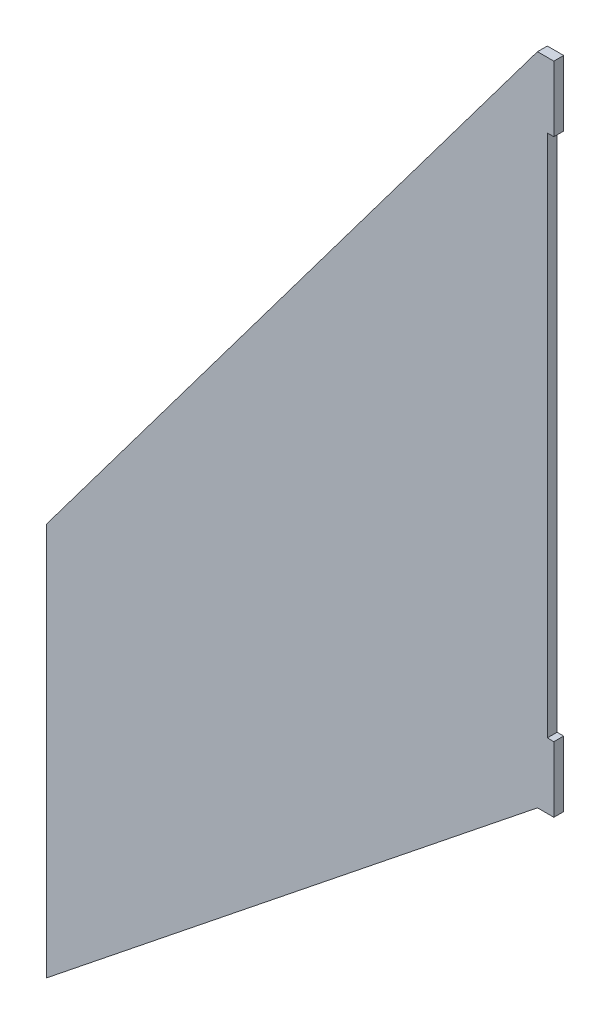
ISO-10303-21;
HEADER;
FILE_DESCRIPTION(('STEP AP214'),'2;1');
FILE_NAME('part.step','',(''),(''),'','','');
FILE_SCHEMA(('AUTOMOTIVE_DESIGN { 1 0 10303 214 1 1 1 1 }'));
ENDSEC;
DATA;
#1=APPLICATION_CONTEXT('core data for automotive mechanical design processes');
#2=APPLICATION_PROTOCOL_DEFINITION('international standard','automotive_design',2000,#1);
#3=PRODUCT_CONTEXT('',#1,'mechanical');
#4=PRODUCT('Part','Part','',(#3));
#5=PRODUCT_RELATED_PRODUCT_CATEGORY('part','',(#4));
#6=PRODUCT_DEFINITION_FORMATION('','',#4);
#7=PRODUCT_DEFINITION_CONTEXT('part definition',#1,'design');
#8=PRODUCT_DEFINITION('design','',#6,#7);
#9=PRODUCT_DEFINITION_SHAPE('','',#8);
#10=(LENGTH_UNIT() NAMED_UNIT(*) SI_UNIT(.MILLI.,.METRE.));
#11=(NAMED_UNIT(*) PLANE_ANGLE_UNIT() SI_UNIT($,.RADIAN.));
#12=(NAMED_UNIT(*) SI_UNIT($,.STERADIAN.) SOLID_ANGLE_UNIT());
#13=UNCERTAINTY_MEASURE_WITH_UNIT(LENGTH_MEASURE(1.E-05),#10,'distance_accuracy_value','');
#14=(GEOMETRIC_REPRESENTATION_CONTEXT(3) GLOBAL_UNCERTAINTY_ASSIGNED_CONTEXT((#13)) GLOBAL_UNIT_ASSIGNED_CONTEXT((#10,
#11,#12)) REPRESENTATION_CONTEXT('',''));
#15=CARTESIAN_POINT('',(0.,0.,0.));
#16=DIRECTION('',(0.,0.,1.));
#17=DIRECTION('',(1.,0.,0.));
#18=AXIS2_PLACEMENT_3D('',#15,#16,#17);
#19=CARTESIAN_POINT('',(0.,0.,3.));
#20=DIRECTION('',(-1.,0.,0.));
#21=DIRECTION('',(0.,-1.,0.));
#22=AXIS2_PLACEMENT_3D('',#19,#20,#21);
#23=PLANE('',#22);
#24=DIRECTION('',(0.,1.,0.));
#25=VECTOR('',#24,1.);
#26=CARTESIAN_POINT('',(0.,0.,0.));
#27=LINE('',#26,#25);
#28=CARTESIAN_POINT('',(0.,-20.,0.));
#29=VERTEX_POINT('',#28);
#30=CARTESIAN_POINT('',(0.,0.,0.));
#31=VERTEX_POINT('',#30);
#32=EDGE_CURVE('E145',#29,#31,#27,.T.);
#33=ORIENTED_EDGE('',*,*,#32,.T.);
#34=DIRECTION('',(0.,0.,-1.));
#35=VECTOR('',#34,1.);
#36=CARTESIAN_POINT('',(0.,0.,3.));
#37=LINE('',#36,#35);
#38=CARTESIAN_POINT('',(0.,0.,3.));
#39=VERTEX_POINT('',#38);
#40=EDGE_CURVE('E11',#39,#31,#37,.T.);
#41=ORIENTED_EDGE('',*,*,#40,.F.);
#42=DIRECTION('',(0.,1.,0.));
#43=VECTOR('',#42,1.);
#44=CARTESIAN_POINT('',(0.,0.,3.));
#45=LINE('',#44,#43);
#46=CARTESIAN_POINT('',(0.,-20.,3.));
#47=VERTEX_POINT('',#46);
#48=EDGE_CURVE('E163',#47,#39,#45,.T.);
#49=ORIENTED_EDGE('',*,*,#48,.F.);
#50=DIRECTION('',(0.,0.,-1.));
#51=VECTOR('',#50,1.);
#52=CARTESIAN_POINT('',(0.,-20.,3.));
#53=LINE('',#52,#51);
#54=EDGE_CURVE('E141',#47,#29,#53,.T.);
#55=ORIENTED_EDGE('',*,*,#54,.T.);
#56=EDGE_LOOP('',(#33,#41,#49,#55));
#57=FACE_BOUND('',#56,.T.);
#58=ADVANCED_FACE('F37',(#57),#23,.F.);
#59=CARTESIAN_POINT('',(0.,0.,3.));
#60=DIRECTION('',(0.,-1.,0.));
#61=DIRECTION('',(1.,0.,0.));
#62=AXIS2_PLACEMENT_3D('',#59,#60,#61);
#63=PLANE('',#62);
#64=DIRECTION('',(-1.,0.,0.));
#65=VECTOR('',#64,1.);
#66=CARTESIAN_POINT('',(0.,0.,0.));
#67=LINE('',#66,#65);
#68=CARTESIAN_POINT('',(-5.,0.,0.));
#69=VERTEX_POINT('',#68);
#70=EDGE_CURVE('E148',#31,#69,#67,.T.);
#71=ORIENTED_EDGE('',*,*,#70,.T.);
#72=DIRECTION('',(0.,0.,-1.));
#73=VECTOR('',#72,1.);
#74=CARTESIAN_POINT('',(-5.,0.,3.));
#75=LINE('',#74,#73);
#76=CARTESIAN_POINT('',(-5.,0.,3.));
#77=VERTEX_POINT('',#76);
#78=EDGE_CURVE('E45',#77,#69,#75,.T.);
#79=ORIENTED_EDGE('',*,*,#78,.F.);
#80=DIRECTION('',(-1.,0.,0.));
#81=VECTOR('',#80,1.);
#82=CARTESIAN_POINT('',(0.,0.,3.));
#83=LINE('',#82,#81);
#84=EDGE_CURVE('E102',#39,#77,#83,.T.);
#85=ORIENTED_EDGE('',*,*,#84,.F.);
#86=ORIENTED_EDGE('',*,*,#40,.T.);
#87=EDGE_LOOP('',(#71,#79,#85,#86));
#88=FACE_BOUND('',#87,.T.);
#89=ADVANCED_FACE('F212',(#88),#63,.F.);
#90=CARTESIAN_POINT('',(-5.,0.,3.));
#91=DIRECTION('',(0.8,-0.6,0.));
#92=DIRECTION('',(0.6,0.8,0.));
#93=AXIS2_PLACEMENT_3D('',#90,#91,#92);
#94=PLANE('',#93);
#95=DIRECTION('',(-0.6,-0.8,0.));
#96=VECTOR('',#95,1.);
#97=CARTESIAN_POINT('',(-5.,0.,0.));
#98=LINE('',#97,#96);
#99=CARTESIAN_POINT('',(-155.,-200.,0.));
#100=VERTEX_POINT('',#99);
#101=EDGE_CURVE('E150',#69,#100,#98,.T.);
#102=ORIENTED_EDGE('',*,*,#101,.T.);
#103=DIRECTION('',(0.,0.,-1.));
#104=VECTOR('',#103,1.);
#105=CARTESIAN_POINT('',(-155.,-200.,3.));
#106=LINE('',#105,#104);
#107=CARTESIAN_POINT('',(-155.,-200.,3.));
#108=VERTEX_POINT('',#107);
#109=EDGE_CURVE('E176',#108,#100,#106,.T.);
#110=ORIENTED_EDGE('',*,*,#109,.F.);
#111=DIRECTION('',(-0.6,-0.8,0.));
#112=VECTOR('',#111,1.);
#113=CARTESIAN_POINT('',(-5.,0.,3.));
#114=LINE('',#113,#112);
#115=EDGE_CURVE('E184',#77,#108,#114,.T.);
#116=ORIENTED_EDGE('',*,*,#115,.F.);
#117=ORIENTED_EDGE('',*,*,#78,.T.);
#118=EDGE_LOOP('',(#102,#110,#116,#117));
#119=FACE_BOUND('',#118,.T.);
#120=ADVANCED_FACE('F182',(#119),#94,.F.);
#121=CARTESIAN_POINT('',(-155.,-200.,3.));
#122=DIRECTION('',(1.,0.,0.));
#123=DIRECTION('',(0.,1.,0.));
#124=AXIS2_PLACEMENT_3D('',#121,#122,#123);
#125=PLANE('',#124);
#126=DIRECTION('',(0.,-1.,0.));
#127=VECTOR('',#126,1.);
#128=CARTESIAN_POINT('',(-155.,-200.,0.));
#129=LINE('',#128,#127);
#130=CARTESIAN_POINT('',(-155.,-320.,0.));
#131=VERTEX_POINT('',#130);
#132=EDGE_CURVE('E152',#100,#131,#129,.T.);
#133=ORIENTED_EDGE('',*,*,#132,.T.);
#134=DIRECTION('',(0.,0.,-1.));
#135=VECTOR('',#134,1.);
#136=CARTESIAN_POINT('',(-155.,-320.,3.));
#137=LINE('',#136,#135);
#138=CARTESIAN_POINT('',(-155.,-320.,3.));
#139=VERTEX_POINT('',#138);
#140=EDGE_CURVE('E173',#139,#131,#137,.T.);
#141=ORIENTED_EDGE('',*,*,#140,.F.);
#142=DIRECTION('',(0.,-1.,0.));
#143=VECTOR('',#142,1.);
#144=CARTESIAN_POINT('',(-155.,-200.,3.));
#145=LINE('',#144,#143);
#146=EDGE_CURVE('E202',#108,#139,#145,.T.);
#147=ORIENTED_EDGE('',*,*,#146,.F.);
#148=ORIENTED_EDGE('',*,*,#109,.T.);
#149=EDGE_LOOP('',(#133,#141,#147,#148));
#150=FACE_BOUND('',#149,.T.);
#151=ADVANCED_FACE('F193',(#150),#125,.F.);
#152=CARTESIAN_POINT('',(-155.,-320.,3.));
#153=DIRECTION('',(-0.624695047554425,0.78086880944303,0.));
#154=DIRECTION('',(-0.78086880944303,-0.624695047554425,0.));
#155=AXIS2_PLACEMENT_3D('',#152,#153,#154);
#156=PLANE('',#155);
#157=DIRECTION('',(0.78086880944303,0.624695047554425,0.));
#158=VECTOR('',#157,1.);
#159=CARTESIAN_POINT('',(-155.,-320.,0.));
#160=LINE('',#159,#158);
#161=CARTESIAN_POINT('',(-4.99999999999998,-200.,0.));
#162=VERTEX_POINT('',#161);
#163=EDGE_CURVE('E154',#131,#162,#160,.T.);
#164=ORIENTED_EDGE('',*,*,#163,.T.);
#165=DIRECTION('',(0.,0.,-1.));
#166=VECTOR('',#165,1.);
#167=CARTESIAN_POINT('',(-4.99999999999998,-200.,3.));
#168=LINE('',#167,#166);
#169=CARTESIAN_POINT('',(-4.99999999999998,-200.,3.));
#170=VERTEX_POINT('',#169);
#171=EDGE_CURVE('E170',#170,#162,#168,.T.);
#172=ORIENTED_EDGE('',*,*,#171,.F.);
#173=DIRECTION('',(0.78086880944303,0.624695047554425,0.));
#174=VECTOR('',#173,1.);
#175=CARTESIAN_POINT('',(-155.,-320.,3.));
#176=LINE('',#175,#174);
#177=EDGE_CURVE('E199',#139,#170,#176,.T.);
#178=ORIENTED_EDGE('',*,*,#177,.F.);
#179=ORIENTED_EDGE('',*,*,#140,.T.);
#180=EDGE_LOOP('',(#164,#172,#178,#179));
#181=FACE_BOUND('',#180,.T.);
#182=ADVANCED_FACE('F197',(#181),#156,.F.);
#183=CARTESIAN_POINT('',(-4.99999999999998,-200.,3.));
#184=DIRECTION('',(0.,1.,0.));
#185=DIRECTION('',(-1.,0.,0.));
#186=AXIS2_PLACEMENT_3D('',#183,#184,#185);
#187=PLANE('',#186);
#188=DIRECTION('',(1.,0.,0.));
#189=VECTOR('',#188,1.);
#190=CARTESIAN_POINT('',(-4.99999999999998,-200.,0.));
#191=LINE('',#190,#189);
#192=CARTESIAN_POINT('',(0.,-200.,0.));
#193=VERTEX_POINT('',#192);
#194=EDGE_CURVE('E156',#162,#193,#191,.T.);
#195=ORIENTED_EDGE('',*,*,#194,.T.);
#196=DIRECTION('',(0.,0.,-1.));
#197=VECTOR('',#196,1.);
#198=CARTESIAN_POINT('',(0.,-200.,3.));
#199=LINE('',#198,#197);
#200=CARTESIAN_POINT('',(0.,-200.,3.));
#201=VERTEX_POINT('',#200);
#202=EDGE_CURVE('E167',#201,#193,#199,.T.);
#203=ORIENTED_EDGE('',*,*,#202,.F.);
#204=DIRECTION('',(1.,0.,0.));
#205=VECTOR('',#204,1.);
#206=CARTESIAN_POINT('',(-4.99999999999998,-200.,3.));
#207=LINE('',#206,#205);
#208=EDGE_CURVE('E201',#170,#201,#207,.T.);
#209=ORIENTED_EDGE('',*,*,#208,.F.);
#210=ORIENTED_EDGE('',*,*,#171,.T.);
#211=EDGE_LOOP('',(#195,#203,#209,#210));
#212=FACE_BOUND('',#211,.T.);
#213=ADVANCED_FACE('F224',(#212),#187,.F.);
#214=CARTESIAN_POINT('',(0.,-200.,3.));
#215=DIRECTION('',(-1.,0.,0.));
#216=DIRECTION('',(0.,-1.,0.));
#217=AXIS2_PLACEMENT_3D('',#214,#215,#216);
#218=PLANE('',#217);
#219=DIRECTION('',(0.,1.,0.));
#220=VECTOR('',#219,1.);
#221=CARTESIAN_POINT('',(0.,-200.,0.));
#222=LINE('',#221,#220);
#223=CARTESIAN_POINT('',(0.,-180.,0.));
#224=VERTEX_POINT('',#223);
#225=EDGE_CURVE('E158',#193,#224,#222,.T.);
#226=ORIENTED_EDGE('',*,*,#225,.T.);
#227=DIRECTION('',(0.,0.,-1.));
#228=VECTOR('',#227,1.);
#229=CARTESIAN_POINT('',(0.,-180.,3.));
#230=LINE('',#229,#228);
#231=CARTESIAN_POINT('',(0.,-180.,3.));
#232=VERTEX_POINT('',#231);
#233=EDGE_CURVE('E136',#232,#224,#230,.T.);
#234=ORIENTED_EDGE('',*,*,#233,.F.);
#235=DIRECTION('',(0.,1.,0.));
#236=VECTOR('',#235,1.);
#237=CARTESIAN_POINT('',(0.,-200.,3.));
#238=LINE('',#237,#236);
#239=EDGE_CURVE('E127',#201,#232,#238,.T.);
#240=ORIENTED_EDGE('',*,*,#239,.F.);
#241=ORIENTED_EDGE('',*,*,#202,.T.);
#242=EDGE_LOOP('',(#226,#234,#240,#241));
#243=FACE_BOUND('',#242,.T.);
#244=ADVANCED_FACE('F227',(#243),#218,.F.);
#245=CARTESIAN_POINT('',(0.,-180.,3.));
#246=DIRECTION('',(0.,-1.,0.));
#247=DIRECTION('',(0.,0.,-1.));
#248=AXIS2_PLACEMENT_3D('',#245,#246,#247);
#249=PLANE('',#248);
#250=DIRECTION('',(-1.,0.,0.));
#251=VECTOR('',#250,1.);
#252=CARTESIAN_POINT('',(0.,-180.,0.));
#253=LINE('',#252,#251);
#254=CARTESIAN_POINT('',(-1.99999999999998,-180.,0.));
#255=VERTEX_POINT('',#254);
#256=EDGE_CURVE('E135',#224,#255,#253,.T.);
#257=ORIENTED_EDGE('',*,*,#256,.T.);
#258=DIRECTION('',(0.,0.,-1.));
#259=VECTOR('',#258,1.);
#260=CARTESIAN_POINT('',(-1.99999999999998,-180.,3.));
#261=LINE('',#260,#259);
#262=CARTESIAN_POINT('',(-1.99999999999998,-180.,3.));
#263=VERTEX_POINT('',#262);
#264=EDGE_CURVE('E132',#263,#255,#261,.T.);
#265=ORIENTED_EDGE('',*,*,#264,.F.);
#266=DIRECTION('',(-1.,0.,0.));
#267=VECTOR('',#266,1.);
#268=CARTESIAN_POINT('',(0.,-180.,3.));
#269=LINE('',#268,#267);
#270=EDGE_CURVE('E121',#232,#263,#269,.T.);
#271=ORIENTED_EDGE('',*,*,#270,.F.);
#272=ORIENTED_EDGE('',*,*,#233,.T.);
#273=EDGE_LOOP('',(#257,#265,#271,#272));
#274=FACE_BOUND('',#273,.T.);
#275=ADVANCED_FACE('F133',(#274),#249,.F.);
#276=CARTESIAN_POINT('',(-2.,-20.,3.));
#277=DIRECTION('',(-1.,0.,0.));
#278=DIRECTION('',(0.,-1.,0.));
#279=AXIS2_PLACEMENT_3D('',#276,#277,#278);
#280=PLANE('',#279);
#281=DIRECTION('',(0.,1.,0.));
#282=VECTOR('',#281,1.);
#283=CARTESIAN_POINT('',(-2.,-20.,0.));
#284=LINE('',#283,#282);
#285=CARTESIAN_POINT('',(-2.,-20.,0.));
#286=VERTEX_POINT('',#285);
#287=EDGE_CURVE('E88',#255,#286,#284,.T.);
#288=ORIENTED_EDGE('',*,*,#287,.T.);
#289=DIRECTION('',(0.,0.,-1.));
#290=VECTOR('',#289,1.);
#291=CARTESIAN_POINT('',(-2.,-20.,3.));
#292=LINE('',#291,#290);
#293=CARTESIAN_POINT('',(-2.,-20.,3.));
#294=VERTEX_POINT('',#293);
#295=EDGE_CURVE('E137',#294,#286,#292,.T.);
#296=ORIENTED_EDGE('',*,*,#295,.F.);
#297=DIRECTION('',(0.,1.,0.));
#298=VECTOR('',#297,1.);
#299=CARTESIAN_POINT('',(-2.,-20.,3.));
#300=LINE('',#299,#298);
#301=EDGE_CURVE('E125',#263,#294,#300,.T.);
#302=ORIENTED_EDGE('',*,*,#301,.F.);
#303=ORIENTED_EDGE('',*,*,#264,.T.);
#304=EDGE_LOOP('',(#288,#296,#302,#303));
#305=FACE_BOUND('',#304,.T.);
#306=ADVANCED_FACE('F139',(#305),#280,.F.);
#307=CARTESIAN_POINT('',(0.,-20.,3.));
#308=DIRECTION('',(0.,1.,0.));
#309=DIRECTION('',(0.,0.,1.));
#310=AXIS2_PLACEMENT_3D('',#307,#308,#309);
#311=PLANE('',#310);
#312=DIRECTION('',(1.,0.,0.));
#313=VECTOR('',#312,1.);
#314=CARTESIAN_POINT('',(0.,-20.,0.));
#315=LINE('',#314,#313);
#316=EDGE_CURVE('E94',#286,#29,#315,.T.);
#317=ORIENTED_EDGE('',*,*,#316,.T.);
#318=ORIENTED_EDGE('',*,*,#54,.F.);
#319=DIRECTION('',(1.,0.,0.));
#320=VECTOR('',#319,1.);
#321=CARTESIAN_POINT('',(0.,-20.,3.));
#322=LINE('',#321,#320);
#323=EDGE_CURVE('E53',#294,#47,#322,.T.);
#324=ORIENTED_EDGE('',*,*,#323,.F.);
#325=ORIENTED_EDGE('',*,*,#295,.T.);
#326=EDGE_LOOP('',(#317,#318,#324,#325));
#327=FACE_BOUND('',#326,.T.);
#328=ADVANCED_FACE('F236',(#327),#311,.F.);
#329=CARTESIAN_POINT('',(0.,0.,3.));
#330=DIRECTION('',(0.,0.,-1.));
#331=DIRECTION('',(-1.,0.,0.));
#332=AXIS2_PLACEMENT_3D('',#329,#330,#331);
#333=PLANE('',#332);
#334=ORIENTED_EDGE('',*,*,#48,.T.);
#335=ORIENTED_EDGE('',*,*,#84,.T.);
#336=ORIENTED_EDGE('',*,*,#115,.T.);
#337=ORIENTED_EDGE('',*,*,#146,.T.);
#338=ORIENTED_EDGE('',*,*,#177,.T.);
#339=ORIENTED_EDGE('',*,*,#208,.T.);
#340=ORIENTED_EDGE('',*,*,#239,.T.);
#341=ORIENTED_EDGE('',*,*,#270,.T.);
#342=ORIENTED_EDGE('',*,*,#301,.T.);
#343=ORIENTED_EDGE('',*,*,#323,.T.);
#344=EDGE_LOOP('',(#334,#335,#336,#337,#338,#339,#340,#341,#342,#343));
#345=FACE_BOUND('',#344,.T.);
#346=ADVANCED_FACE('F123',(#345),#333,.F.);
#347=CARTESIAN_POINT('',(0.,0.,0.));
#348=DIRECTION('',(0.,0.,-1.));
#349=DIRECTION('',(-1.,0.,0.));
#350=AXIS2_PLACEMENT_3D('',#347,#348,#349);
#351=PLANE('',#350);
#352=ORIENTED_EDGE('',*,*,#32,.F.);
#353=ORIENTED_EDGE('',*,*,#316,.F.);
#354=ORIENTED_EDGE('',*,*,#287,.F.);
#355=ORIENTED_EDGE('',*,*,#256,.F.);
#356=ORIENTED_EDGE('',*,*,#225,.F.);
#357=ORIENTED_EDGE('',*,*,#194,.F.);
#358=ORIENTED_EDGE('',*,*,#163,.F.);
#359=ORIENTED_EDGE('',*,*,#132,.F.);
#360=ORIENTED_EDGE('',*,*,#101,.F.);
#361=ORIENTED_EDGE('',*,*,#70,.F.);
#362=EDGE_LOOP('',(#352,#353,#354,#355,#356,#357,#358,#359,#360,#361));
#363=FACE_BOUND('',#362,.T.);
#364=ADVANCED_FACE('F188',(#363),#351,.T.);
#365=CLOSED_SHELL('',(#58,#89,#120,#151,#182,#213,#244,#275,#306,#328,#346,#364));
#366=MANIFOLD_SOLID_BREP('B2',#365);
#367=ADVANCED_BREP_SHAPE_REPRESENTATION('',(#18,#366),#14);
#368=SHAPE_DEFINITION_REPRESENTATION(#9,#367);
ENDSEC;
END-ISO-10303-21;
